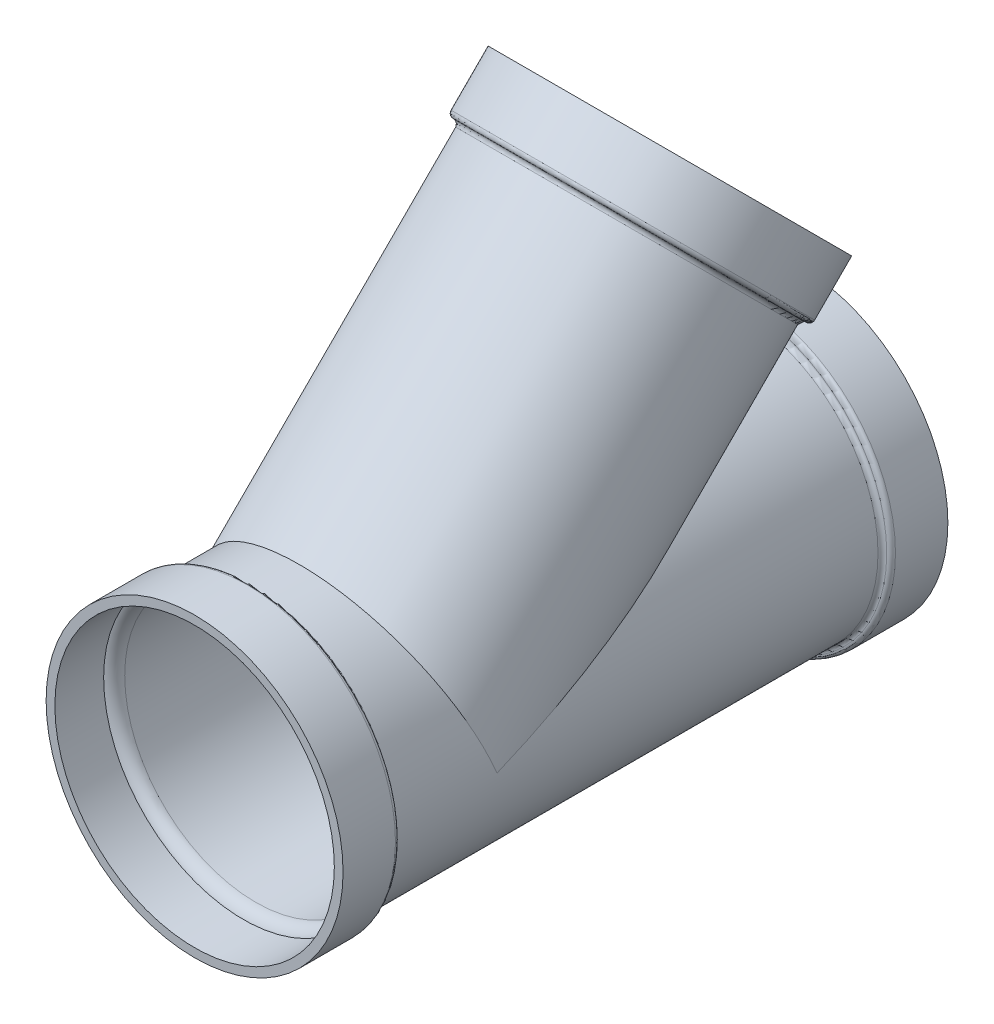
ISO-10303-21;
HEADER;
FILE_DESCRIPTION(('STEP AP214'),'2;1');
FILE_NAME('part.step','',(''),(''),'','','');
FILE_SCHEMA(('AUTOMOTIVE_DESIGN { 1 0 10303 214 1 1 1 1 }'));
ENDSEC;
DATA;
#1=APPLICATION_CONTEXT('core data for automotive mechanical design processes');
#2=APPLICATION_PROTOCOL_DEFINITION('international standard','automotive_design',2000,#1);
#3=PRODUCT_CONTEXT('',#1,'mechanical');
#4=PRODUCT('Part','Part','',(#3));
#5=PRODUCT_RELATED_PRODUCT_CATEGORY('part','',(#4));
#6=PRODUCT_DEFINITION_FORMATION('','',#4);
#7=PRODUCT_DEFINITION_CONTEXT('part definition',#1,'design');
#8=PRODUCT_DEFINITION('design','',#6,#7);
#9=PRODUCT_DEFINITION_SHAPE('','',#8);
#10=(LENGTH_UNIT() NAMED_UNIT(*) SI_UNIT(.MILLI.,.METRE.));
#11=(NAMED_UNIT(*) PLANE_ANGLE_UNIT() SI_UNIT($,.RADIAN.));
#12=(NAMED_UNIT(*) SI_UNIT($,.STERADIAN.) SOLID_ANGLE_UNIT());
#13=UNCERTAINTY_MEASURE_WITH_UNIT(LENGTH_MEASURE(1.E-05),#10,'distance_accuracy_value','');
#14=(GEOMETRIC_REPRESENTATION_CONTEXT(3) GLOBAL_UNCERTAINTY_ASSIGNED_CONTEXT((#13)) GLOBAL_UNIT_ASSIGNED_CONTEXT((#10,
#11,#12)) REPRESENTATION_CONTEXT('',''));
#15=CARTESIAN_POINT('',(0.,0.,0.));
#16=DIRECTION('',(0.,0.,1.));
#17=DIRECTION('',(1.,0.,0.));
#18=AXIS2_PLACEMENT_3D('',#15,#16,#17);
#19=CARTESIAN_POINT('',(0.,0.,203.2));
#20=DIRECTION('',(0.,-0.707106781186549,0.707106781186546));
#21=DIRECTION('',(0.,-0.707106781186546,-0.707106781186549));
#22=AXIS2_PLACEMENT_3D('',#19,#20,#21);
#23=CYLINDRICAL_SURFACE('',#22,190.5);
#24=CARTESIAN_POINT('',(0.,391.763673281643,-188.563673281641));
#25=DIRECTION('',(0.,-0.707106781186549,0.707106781186546));
#26=DIRECTION('',(0.,-0.707106781186546,-0.707106781186549));
#27=AXIS2_PLACEMENT_3D('',#24,#25,#26);
#28=CIRCLE('',#27,190.5);
#29=CARTESIAN_POINT('',(0.,257.059831465606,-323.267515097679));
#30=VERTEX_POINT('',#29);
#31=EDGE_CURVE('E83',#30,#30,#28,.T.);
#32=ORIENTED_EDGE('',*,*,#31,.F.);
#33=EDGE_LOOP('',(#32));
#34=FACE_BOUND('',#33,.T.);
#35=CARTESIAN_POINT('',(0.,0.,203.2));
#36=DIRECTION('',(0.,-0.923879532511286,-0.382683432365091));
#37=DIRECTION('',(0.,-0.382683432365091,0.923879532511286));
#38=AXIS2_PLACEMENT_3D('',#35,#36,#37);
#39=ELLIPSE('',#38,497.800489617898,190.5);
#40=CARTESIAN_POINT('',(-190.5,1.34203706667238E-13,203.2));
#41=VERTEX_POINT('',#40);
#42=CARTESIAN_POINT('',(190.5,3.09111952803367E-13,203.2));
#43=VERTEX_POINT('',#42);
#44=EDGE_CURVE('E75',#41,#43,#39,.T.);
#45=ORIENTED_EDGE('',*,*,#44,.T.);
#46=CARTESIAN_POINT('',(0.,0.,203.2));
#47=DIRECTION('',(0.,-0.382683432365091,0.923879532511286));
#48=DIRECTION('',(0.,-0.923879532511286,-0.382683432365091));
#49=AXIS2_PLACEMENT_3D('',#46,#47,#48);
#50=ELLIPSE('',#49,206.195714155701,190.5);
#51=EDGE_CURVE('E61',#43,#41,#50,.T.);
#52=ORIENTED_EDGE('',*,*,#51,.T.);
#53=EDGE_LOOP('',(#45,#52));
#54=FACE_BOUND('',#53,.T.);
#55=ADVANCED_FACE('F43',(#34,#54),#23,.F.);
#56=CARTESIAN_POINT('',(0.,0.,168.70511138535));
#57=DIRECTION('',(0.,0.,1.));
#58=DIRECTION('',(1.,0.,0.));
#59=AXIS2_PLACEMENT_3D('',#56,#57,#58);
#60=CYLINDRICAL_SURFACE('',#59,203.2);
#61=CARTESIAN_POINT('',(0.,0.,-350.8375));
#62=DIRECTION('',(0.,0.,1.));
#63=DIRECTION('',(1.,0.,0.));
#64=AXIS2_PLACEMENT_3D('',#61,#62,#63);
#65=CIRCLE('',#64,203.2);
#66=CARTESIAN_POINT('',(203.2,0.,-350.8375));
#67=VERTEX_POINT('',#66);
#68=EDGE_CURVE('E131',#67,#67,#65,.T.);
#69=ORIENTED_EDGE('',*,*,#68,.T.);
#70=EDGE_LOOP('',(#69));
#71=FACE_BOUND('',#70,.T.);
#72=CARTESIAN_POINT('',(0.,0.,350.8375));
#73=DIRECTION('',(0.,0.,1.));
#74=DIRECTION('',(1.,0.,0.));
#75=AXIS2_PLACEMENT_3D('',#72,#73,#74);
#76=CIRCLE('',#75,203.2);
#77=CARTESIAN_POINT('',(203.2,0.,350.8375));
#78=VERTEX_POINT('',#77);
#79=EDGE_CURVE('E127',#78,#78,#76,.T.);
#80=ORIENTED_EDGE('',*,*,#79,.F.);
#81=EDGE_LOOP('',(#80));
#82=FACE_BOUND('',#81,.T.);
#83=CARTESIAN_POINT('',(0.,0.,203.2));
#84=DIRECTION('',(0.,-0.382683432365091,0.923879532511286));
#85=DIRECTION('',(0.,0.923879532511286,0.382683432365091));
#86=AXIS2_PLACEMENT_3D('',#83,#84,#85);
#87=ELLIPSE('',#86,219.942095099414,203.2);
#88=CARTESIAN_POINT('',(-203.2,0.,203.2));
#89=VERTEX_POINT('',#88);
#90=CARTESIAN_POINT('',(203.2,0.,203.2));
#91=VERTEX_POINT('',#90);
#92=EDGE_CURVE('E11',#89,#91,#87,.F.);
#93=ORIENTED_EDGE('',*,*,#92,.F.);
#94=CARTESIAN_POINT('',(0.,0.,203.2));
#95=DIRECTION('',(0.,0.923879532511286,0.382683432365091));
#96=DIRECTION('',(0.,-0.382683432365091,0.923879532511286));
#97=AXIS2_PLACEMENT_3D('',#94,#95,#96);
#98=ELLIPSE('',#97,530.987188925758,203.2);
#99=EDGE_CURVE('E52',#91,#89,#98,.T.);
#100=ORIENTED_EDGE('',*,*,#99,.F.);
#101=EDGE_LOOP('',(#93,#100));
#102=FACE_BOUND('',#101,.T.);
#103=ADVANCED_FACE('F150',(#71,#82,#102),#60,.T.);
#104=CARTESIAN_POINT('',(0.,-1.03233132742625E-13,439.7375));
#105=DIRECTION('',(0.,0.,-1.));
#106=DIRECTION('',(-1.,0.,0.));
#107=AXIS2_PLACEMENT_3D('',#104,#105,#106);
#108=PLANE('',#107);
#109=CARTESIAN_POINT('',(0.,0.,439.7375));
#110=DIRECTION('',(0.,0.,1.));
#111=DIRECTION('',(1.,0.,0.));
#112=AXIS2_PLACEMENT_3D('',#109,#110,#111);
#113=CIRCLE('',#112,203.2);
#114=CARTESIAN_POINT('',(203.2,0.,439.7375));
#115=VERTEX_POINT('',#114);
#116=EDGE_CURVE('E190',#115,#115,#113,.T.);
#117=ORIENTED_EDGE('',*,*,#116,.F.);
#118=EDGE_LOOP('',(#117));
#119=FACE_BOUND('',#118,.T.);
#120=CARTESIAN_POINT('',(0.,0.,439.7375));
#121=DIRECTION('',(0.,0.,1.));
#122=DIRECTION('',(1.,0.,0.));
#123=AXIS2_PLACEMENT_3D('',#120,#121,#122);
#124=CIRCLE('',#123,215.9);
#125=CARTESIAN_POINT('',(215.9,0.,439.7375));
#126=VERTEX_POINT('',#125);
#127=EDGE_CURVE('E115',#126,#126,#124,.T.);
#128=ORIENTED_EDGE('',*,*,#127,.T.);
#129=EDGE_LOOP('',(#128));
#130=FACE_BOUND('',#129,.T.);
#131=ADVANCED_FACE('F45',(#119,#130),#108,.F.);
#132=CARTESIAN_POINT('',(0.,215.9,-439.7375));
#133=DIRECTION('',(0.,0.,1.));
#134=DIRECTION('',(1.,0.,0.));
#135=AXIS2_PLACEMENT_3D('',#132,#133,#134);
#136=PLANE('',#135);
#137=CARTESIAN_POINT('',(0.,0.,-439.7375));
#138=DIRECTION('',(0.,0.,1.));
#139=DIRECTION('',(1.,0.,0.));
#140=AXIS2_PLACEMENT_3D('',#137,#138,#139);
#141=CIRCLE('',#140,203.2);
#142=CARTESIAN_POINT('',(203.2,0.,-439.7375));
#143=VERTEX_POINT('',#142);
#144=EDGE_CURVE('E185',#143,#143,#141,.T.);
#145=ORIENTED_EDGE('',*,*,#144,.T.);
#146=EDGE_LOOP('',(#145));
#147=FACE_BOUND('',#146,.T.);
#148=CARTESIAN_POINT('',(0.,0.,-439.7375));
#149=DIRECTION('',(0.,0.,1.));
#150=DIRECTION('',(1.,0.,0.));
#151=AXIS2_PLACEMENT_3D('',#148,#149,#150);
#152=CIRCLE('',#151,215.9);
#153=CARTESIAN_POINT('',(215.9,0.,-439.7375));
#154=VERTEX_POINT('',#153);
#155=EDGE_CURVE('E143',#154,#154,#152,.T.);
#156=ORIENTED_EDGE('',*,*,#155,.F.);
#157=EDGE_LOOP('',(#156));
#158=FACE_BOUND('',#157,.T.);
#159=ADVANCED_FACE('F158',(#147,#158),#136,.F.);
#160=CARTESIAN_POINT('',(0.,0.,168.70511138535));
#161=DIRECTION('',(0.,0.,1.));
#162=DIRECTION('',(1.,0.,0.));
#163=AXIS2_PLACEMENT_3D('',#160,#161,#162);
#164=CYLINDRICAL_SURFACE('',#163,215.9);
#165=CARTESIAN_POINT('',(0.,0.,-363.5375));
#166=DIRECTION('',(0.,0.,1.));
#167=DIRECTION('',(1.,0.,0.));
#168=AXIS2_PLACEMENT_3D('',#165,#166,#167);
#169=CIRCLE('',#168,215.9);
#170=CARTESIAN_POINT('',(215.9,0.,-363.5375));
#171=VERTEX_POINT('',#170);
#172=EDGE_CURVE('E139',#171,#171,#169,.T.);
#173=ORIENTED_EDGE('',*,*,#172,.F.);
#174=EDGE_LOOP('',(#173));
#175=FACE_BOUND('',#174,.T.);
#176=ORIENTED_EDGE('',*,*,#155,.T.);
#177=EDGE_LOOP('',(#176));
#178=FACE_BOUND('',#177,.T.);
#179=ADVANCED_FACE('F174',(#175,#178),#164,.T.);
#180=CARTESIAN_POINT('',(0.,0.,-363.5375));
#181=DIRECTION('',(0.,0.,1.));
#182=DIRECTION('',(1.,0.,0.));
#183=AXIS2_PLACEMENT_3D('',#180,#181,#182);
#184=TOROIDAL_SURFACE('',#183,209.55,6.35000000000002);
#185=CARTESIAN_POINT('',(0.,0.,-357.1875));
#186=DIRECTION('',(0.,0.,1.));
#187=DIRECTION('',(1.,0.,0.));
#188=AXIS2_PLACEMENT_3D('',#185,#186,#187);
#189=CIRCLE('',#188,209.55);
#190=CARTESIAN_POINT('',(209.55,0.,-357.1875));
#191=VERTEX_POINT('',#190);
#192=EDGE_CURVE('E135',#191,#191,#189,.T.);
#193=ORIENTED_EDGE('',*,*,#192,.F.);
#194=EDGE_LOOP('',(#193));
#195=FACE_BOUND('',#194,.T.);
#196=ORIENTED_EDGE('',*,*,#172,.T.);
#197=EDGE_LOOP('',(#196));
#198=FACE_BOUND('',#197,.T.);
#199=ADVANCED_FACE('F170',(#195,#198),#184,.T.);
#200=CARTESIAN_POINT('',(0.,0.,-350.8375));
#201=DIRECTION('',(0.,0.,1.));
#202=DIRECTION('',(1.,0.,0.));
#203=AXIS2_PLACEMENT_3D('',#200,#201,#202);
#204=TOROIDAL_SURFACE('',#203,209.55,6.34999999999999);
#205=ORIENTED_EDGE('',*,*,#68,.F.);
#206=EDGE_LOOP('',(#205));
#207=FACE_BOUND('',#206,.T.);
#208=ORIENTED_EDGE('',*,*,#192,.T.);
#209=EDGE_LOOP('',(#208));
#210=FACE_BOUND('',#209,.T.);
#211=ADVANCED_FACE('F167',(#207,#210),#204,.F.);
#212=CARTESIAN_POINT('',(0.,0.,350.8375));
#213=DIRECTION('',(0.,0.,1.));
#214=DIRECTION('',(1.,0.,0.));
#215=AXIS2_PLACEMENT_3D('',#212,#213,#214);
#216=TOROIDAL_SURFACE('',#215,209.55,6.34999999999999);
#217=CARTESIAN_POINT('',(0.,0.,357.1875));
#218=DIRECTION('',(0.,0.,1.));
#219=DIRECTION('',(1.,0.,0.));
#220=AXIS2_PLACEMENT_3D('',#217,#218,#219);
#221=CIRCLE('',#220,209.55);
#222=CARTESIAN_POINT('',(209.55,0.,357.1875));
#223=VERTEX_POINT('',#222);
#224=EDGE_CURVE('E123',#223,#223,#221,.T.);
#225=ORIENTED_EDGE('',*,*,#224,.F.);
#226=EDGE_LOOP('',(#225));
#227=FACE_BOUND('',#226,.T.);
#228=ORIENTED_EDGE('',*,*,#79,.T.);
#229=EDGE_LOOP('',(#228));
#230=FACE_BOUND('',#229,.T.);
#231=ADVANCED_FACE('F165',(#227,#230),#216,.F.);
#232=CARTESIAN_POINT('',(0.,0.,363.5375));
#233=DIRECTION('',(0.,0.,1.));
#234=DIRECTION('',(1.,0.,0.));
#235=AXIS2_PLACEMENT_3D('',#232,#233,#234);
#236=TOROIDAL_SURFACE('',#235,209.55,6.35000000000002);
#237=CARTESIAN_POINT('',(0.,0.,363.5375));
#238=DIRECTION('',(0.,0.,1.));
#239=DIRECTION('',(1.,0.,0.));
#240=AXIS2_PLACEMENT_3D('',#237,#238,#239);
#241=CIRCLE('',#240,215.9);
#242=CARTESIAN_POINT('',(215.9,0.,363.5375));
#243=VERTEX_POINT('',#242);
#244=EDGE_CURVE('E119',#243,#243,#241,.T.);
#245=ORIENTED_EDGE('',*,*,#244,.F.);
#246=EDGE_LOOP('',(#245));
#247=FACE_BOUND('',#246,.T.);
#248=ORIENTED_EDGE('',*,*,#224,.T.);
#249=EDGE_LOOP('',(#248));
#250=FACE_BOUND('',#249,.T.);
#251=ADVANCED_FACE('F258',(#247,#250),#236,.T.);
#252=CARTESIAN_POINT('',(0.,0.,168.70511138535));
#253=DIRECTION('',(0.,0.,1.));
#254=DIRECTION('',(1.,0.,0.));
#255=AXIS2_PLACEMENT_3D('',#252,#253,#254);
#256=CYLINDRICAL_SURFACE('',#255,215.9);
#257=ORIENTED_EDGE('',*,*,#127,.F.);
#258=EDGE_LOOP('',(#257));
#259=FACE_BOUND('',#258,.T.);
#260=ORIENTED_EDGE('',*,*,#244,.T.);
#261=EDGE_LOOP('',(#260));
#262=FACE_BOUND('',#261,.T.);
#263=ADVANCED_FACE('F241',(#259,#262),#256,.T.);
#264=CARTESIAN_POINT('',(0.,0.,203.2));
#265=DIRECTION('',(0.,-0.707106781186549,0.707106781186546));
#266=DIRECTION('',(0.,-0.707106781186546,-0.707106781186549));
#267=AXIS2_PLACEMENT_3D('',#264,#265,#266);
#268=CYLINDRICAL_SURFACE('',#267,203.2);
#269=CARTESIAN_POINT('',(0.,391.763673281643,-188.563673281641));
#270=DIRECTION('',(0.,-0.707106781186549,0.707106781186546));
#271=DIRECTION('',(0.,-0.707106781186546,-0.707106781186549));
#272=AXIS2_PLACEMENT_3D('',#269,#270,#271);
#273=CIRCLE('',#272,203.2);
#274=CARTESIAN_POINT('',(0.,248.079575344536,-332.247771218748));
#275=VERTEX_POINT('',#274);
#276=EDGE_CURVE('E99',#275,#275,#273,.T.);
#277=ORIENTED_EDGE('',*,*,#276,.T.);
#278=EDGE_LOOP('',(#277));
#279=FACE_BOUND('',#278,.T.);
#280=ORIENTED_EDGE('',*,*,#99,.T.);
#281=ORIENTED_EDGE('',*,*,#92,.T.);
#282=EDGE_LOOP('',(#280,#281));
#283=FACE_BOUND('',#282,.T.);
#284=ADVANCED_FACE('F149',(#279,#283),#268,.T.);
#285=CARTESIAN_POINT('',(0.,607.289820187302,-98.7611120709492));
#286=DIRECTION('',(0.,-0.707106781186549,0.707106781186546));
#287=DIRECTION('',(0.,-0.707106781186546,-0.707106781186549));
#288=AXIS2_PLACEMENT_3D('',#285,#286,#287);
#289=PLANE('',#288);
#290=CARTESIAN_POINT('',(0.,454.625466129127,-251.425466129126));
#291=DIRECTION('',(0.,-0.707106781186549,0.707106781186546));
#292=DIRECTION('',(0.,-0.707106781186546,-0.707106781186549));
#293=AXIS2_PLACEMENT_3D('',#290,#291,#292);
#294=CIRCLE('',#293,203.2);
#295=CARTESIAN_POINT('',(0.,310.941368192021,-395.109564066232));
#296=VERTEX_POINT('',#295);
#297=EDGE_CURVE('E95',#296,#296,#294,.T.);
#298=ORIENTED_EDGE('',*,*,#297,.T.);
#299=EDGE_LOOP('',(#298));
#300=FACE_BOUND('',#299,.T.);
#301=CARTESIAN_POINT('',(0.,454.625466129127,-251.425466129125));
#302=DIRECTION('',(0.,-0.707106781186549,0.707106781186546));
#303=DIRECTION('',(0.,-0.707106781186546,-0.707106781186549));
#304=AXIS2_PLACEMENT_3D('',#301,#302,#303);
#305=CIRCLE('',#304,215.9);
#306=CARTESIAN_POINT('',(0.,301.961112070952,-404.089820187301));
#307=VERTEX_POINT('',#306);
#308=EDGE_CURVE('E111',#307,#307,#305,.T.);
#309=ORIENTED_EDGE('',*,*,#308,.F.);
#310=EDGE_LOOP('',(#309));
#311=FACE_BOUND('',#310,.T.);
#312=ADVANCED_FACE('F240',(#300,#311),#289,.F.);
#313=CARTESIAN_POINT('',(0.,0.,203.2));
#314=DIRECTION('',(0.,-0.707106781186549,0.707106781186546));
#315=DIRECTION('',(0.,-0.707106781186546,-0.707106781186549));
#316=AXIS2_PLACEMENT_3D('',#313,#314,#315);
#317=CYLINDRICAL_SURFACE('',#316,215.9);
#318=CARTESIAN_POINT('',(0.,400.743929402712,-197.54392940271));
#319=DIRECTION('',(0.,-0.707106781186549,0.707106781186546));
#320=DIRECTION('',(0.,-0.707106781186546,-0.707106781186549));
#321=AXIS2_PLACEMENT_3D('',#318,#319,#320);
#322=CIRCLE('',#321,215.9);
#323=CARTESIAN_POINT('',(0.,248.079575344537,-350.208283460886));
#324=VERTEX_POINT('',#323);
#325=EDGE_CURVE('E107',#324,#324,#322,.T.);
#326=ORIENTED_EDGE('',*,*,#325,.F.);
#327=EDGE_LOOP('',(#326));
#328=FACE_BOUND('',#327,.T.);
#329=ORIENTED_EDGE('',*,*,#308,.T.);
#330=EDGE_LOOP('',(#329));
#331=FACE_BOUND('',#330,.T.);
#332=ADVANCED_FACE('F249',(#328,#331),#317,.T.);
#333=CARTESIAN_POINT('',(0.,400.743929402712,-197.54392940271));
#334=DIRECTION('',(0.,-0.707106781186549,0.707106781186546));
#335=DIRECTION('',(0.,-0.707106781186546,-0.707106781186549));
#336=AXIS2_PLACEMENT_3D('',#333,#334,#335);
#337=TOROIDAL_SURFACE('',#336,209.55,6.34999999999991);
#338=CARTESIAN_POINT('',(0.,396.253801342177,-193.053801342176));
#339=DIRECTION('',(0.,-0.707106781186549,0.707106781186546));
#340=DIRECTION('',(0.,-0.707106781186546,-0.707106781186549));
#341=AXIS2_PLACEMENT_3D('',#338,#339,#340);
#342=CIRCLE('',#341,209.55);
#343=CARTESIAN_POINT('',(0.,248.079575344536,-341.228027339817));
#344=VERTEX_POINT('',#343);
#345=EDGE_CURVE('E103',#344,#344,#342,.T.);
#346=ORIENTED_EDGE('',*,*,#345,.F.);
#347=EDGE_LOOP('',(#346));
#348=FACE_BOUND('',#347,.T.);
#349=ORIENTED_EDGE('',*,*,#325,.T.);
#350=EDGE_LOOP('',(#349));
#351=FACE_BOUND('',#350,.T.);
#352=ADVANCED_FACE('F245',(#348,#351),#337,.T.);
#353=CARTESIAN_POINT('',(0.,391.763673281643,-188.563673281641));
#354=DIRECTION('',(0.,-0.707106781186549,0.707106781186546));
#355=DIRECTION('',(0.,-0.707106781186546,-0.707106781186549));
#356=AXIS2_PLACEMENT_3D('',#353,#354,#355);
#357=TOROIDAL_SURFACE('',#356,209.55,6.35000000000004);
#358=ORIENTED_EDGE('',*,*,#276,.F.);
#359=EDGE_LOOP('',(#358));
#360=FACE_BOUND('',#359,.T.);
#361=ORIENTED_EDGE('',*,*,#345,.T.);
#362=EDGE_LOOP('',(#361));
#363=FACE_BOUND('',#362,.T.);
#364=ADVANCED_FACE('F236',(#360,#363),#357,.F.);
#365=CARTESIAN_POINT('',(0.,0.,203.2));
#366=DIRECTION('',(0.,-0.707106781186549,0.707106781186546));
#367=DIRECTION('',(0.,-0.707106781186546,-0.707106781186549));
#368=AXIS2_PLACEMENT_3D('',#365,#366,#367);
#369=CYLINDRICAL_SURFACE('',#368,203.2);
#370=CARTESIAN_POINT('',(0.,404.463673281643,-201.263673281641));
#371=DIRECTION('',(0.,-0.707106781186549,0.707106781186546));
#372=DIRECTION('',(0.,-0.707106781186546,-0.707106781186549));
#373=AXIS2_PLACEMENT_3D('',#370,#371,#372);
#374=CIRCLE('',#373,203.2);
#375=CARTESIAN_POINT('',(0.,260.779575344537,-344.947771218748));
#376=VERTEX_POINT('',#375);
#377=EDGE_CURVE('E88',#376,#376,#374,.T.);
#378=ORIENTED_EDGE('',*,*,#377,.T.);
#379=EDGE_LOOP('',(#378));
#380=FACE_BOUND('',#379,.T.);
#381=ORIENTED_EDGE('',*,*,#297,.F.);
#382=EDGE_LOOP('',(#381));
#383=FACE_BOUND('',#382,.T.);
#384=ADVANCED_FACE('F232',(#380,#383),#369,.F.);
#385=CARTESIAN_POINT('',(0.,391.763673281643,-188.563673281641));
#386=DIRECTION('',(0.,-0.707106781186549,0.707106781186546));
#387=DIRECTION('',(0.,-0.707106781186546,-0.707106781186549));
#388=AXIS2_PLACEMENT_3D('',#385,#386,#387);
#389=TOROIDAL_SURFACE('',#388,209.55,19.0500000000001);
#390=ORIENTED_EDGE('',*,*,#31,.T.);
#391=EDGE_LOOP('',(#390));
#392=FACE_BOUND('',#391,.T.);
#393=ORIENTED_EDGE('',*,*,#377,.F.);
#394=EDGE_LOOP('',(#393));
#395=FACE_BOUND('',#394,.T.);
#396=ADVANCED_FACE('F226',(#392,#395),#389,.T.);
#397=CARTESIAN_POINT('',(0.,0.,-350.8375));
#398=DIRECTION('',(0.,0.,1.));
#399=DIRECTION('',(1.,0.,0.));
#400=AXIS2_PLACEMENT_3D('',#397,#398,#399);
#401=TOROIDAL_SURFACE('',#400,209.55,19.05);
#402=CARTESIAN_POINT('',(0.,0.,-350.8375));
#403=DIRECTION('',(0.,0.,1.));
#404=DIRECTION('',(1.,0.,0.));
#405=AXIS2_PLACEMENT_3D('',#402,#403,#404);
#406=CIRCLE('',#405,190.5);
#407=CARTESIAN_POINT('',(190.5,0.,-350.8375));
#408=VERTEX_POINT('',#407);
#409=EDGE_CURVE('E80',#408,#408,#406,.T.);
#410=ORIENTED_EDGE('',*,*,#409,.T.);
#411=EDGE_LOOP('',(#410));
#412=FACE_BOUND('',#411,.T.);
#413=CARTESIAN_POINT('',(0.,0.,-368.798012242138));
#414=DIRECTION('',(0.,0.,1.));
#415=DIRECTION('',(1.,0.,0.));
#416=AXIS2_PLACEMENT_3D('',#413,#414,#415);
#417=CIRCLE('',#416,203.2);
#418=CARTESIAN_POINT('',(203.2,0.,-368.798012242138));
#419=VERTEX_POINT('',#418);
#420=EDGE_CURVE('E191',#419,#419,#417,.T.);
#421=ORIENTED_EDGE('',*,*,#420,.F.);
#422=EDGE_LOOP('',(#421));
#423=FACE_BOUND('',#422,.T.);
#424=ADVANCED_FACE('F213',(#412,#423),#401,.T.);
#425=CARTESIAN_POINT('',(0.,0.,168.70511138535));
#426=DIRECTION('',(0.,0.,1.));
#427=DIRECTION('',(1.,0.,0.));
#428=AXIS2_PLACEMENT_3D('',#425,#426,#427);
#429=CYLINDRICAL_SURFACE('',#428,190.5);
#430=ORIENTED_EDGE('',*,*,#44,.F.);
#431=ORIENTED_EDGE('',*,*,#51,.F.);
#432=EDGE_LOOP('',(#430,#431));
#433=FACE_BOUND('',#432,.T.);
#434=CARTESIAN_POINT('',(0.,0.,350.8375));
#435=DIRECTION('',(0.,0.,1.));
#436=DIRECTION('',(1.,0.,0.));
#437=AXIS2_PLACEMENT_3D('',#434,#435,#436);
#438=CIRCLE('',#437,190.5);
#439=CARTESIAN_POINT('',(190.5,0.,350.8375));
#440=VERTEX_POINT('',#439);
#441=EDGE_CURVE('E205',#440,#440,#438,.T.);
#442=ORIENTED_EDGE('',*,*,#441,.T.);
#443=EDGE_LOOP('',(#442));
#444=FACE_BOUND('',#443,.T.);
#445=ORIENTED_EDGE('',*,*,#409,.F.);
#446=EDGE_LOOP('',(#445));
#447=FACE_BOUND('',#446,.T.);
#448=ADVANCED_FACE('F76',(#433,#444,#447),#429,.F.);
#449=CARTESIAN_POINT('',(0.,0.,350.8375));
#450=DIRECTION('',(0.,0.,1.));
#451=DIRECTION('',(1.,0.,0.));
#452=AXIS2_PLACEMENT_3D('',#449,#450,#451);
#453=TOROIDAL_SURFACE('',#452,209.55,19.05);
#454=CARTESIAN_POINT('',(0.,0.,368.798012242138));
#455=DIRECTION('',(0.,0.,1.));
#456=DIRECTION('',(1.,0.,0.));
#457=AXIS2_PLACEMENT_3D('',#454,#455,#456);
#458=CIRCLE('',#457,203.2);
#459=CARTESIAN_POINT('',(203.2,0.,368.798012242138));
#460=VERTEX_POINT('',#459);
#461=EDGE_CURVE('E197',#460,#460,#458,.T.);
#462=ORIENTED_EDGE('',*,*,#461,.T.);
#463=EDGE_LOOP('',(#462));
#464=FACE_BOUND('',#463,.T.);
#465=ORIENTED_EDGE('',*,*,#441,.F.);
#466=EDGE_LOOP('',(#465));
#467=FACE_BOUND('',#466,.T.);
#468=ADVANCED_FACE('F217',(#464,#467),#453,.T.);
#469=CARTESIAN_POINT('',(0.,0.,168.70511138535));
#470=DIRECTION('',(0.,0.,1.));
#471=DIRECTION('',(1.,0.,0.));
#472=AXIS2_PLACEMENT_3D('',#469,#470,#471);
#473=CYLINDRICAL_SURFACE('',#472,203.2);
#474=ORIENTED_EDGE('',*,*,#116,.T.);
#475=EDGE_LOOP('',(#474));
#476=FACE_BOUND('',#475,.T.);
#477=ORIENTED_EDGE('',*,*,#461,.F.);
#478=EDGE_LOOP('',(#477));
#479=FACE_BOUND('',#478,.T.);
#480=ADVANCED_FACE('F223',(#476,#479),#473,.F.);
#481=CARTESIAN_POINT('',(0.,0.,168.70511138535));
#482=DIRECTION('',(0.,0.,1.));
#483=DIRECTION('',(1.,0.,0.));
#484=AXIS2_PLACEMENT_3D('',#481,#482,#483);
#485=CYLINDRICAL_SURFACE('',#484,203.2);
#486=ORIENTED_EDGE('',*,*,#420,.T.);
#487=EDGE_LOOP('',(#486));
#488=FACE_BOUND('',#487,.T.);
#489=ORIENTED_EDGE('',*,*,#144,.F.);
#490=EDGE_LOOP('',(#489));
#491=FACE_BOUND('',#490,.T.);
#492=ADVANCED_FACE('F423',(#488,#491),#485,.F.);
#493=CLOSED_SHELL('',(#55,#103,#131,#159,#179,#199,#211,#231,#251,#263,#284,#312,#332,#352,#364,
#384,#396,#424,#448,#468,#480,#492));
#494=MANIFOLD_SOLID_BREP('B2',#493);
#495=ADVANCED_BREP_SHAPE_REPRESENTATION('',(#18,#494),#14);
#496=SHAPE_DEFINITION_REPRESENTATION(#9,#495);
ENDSEC;
END-ISO-10303-21;
